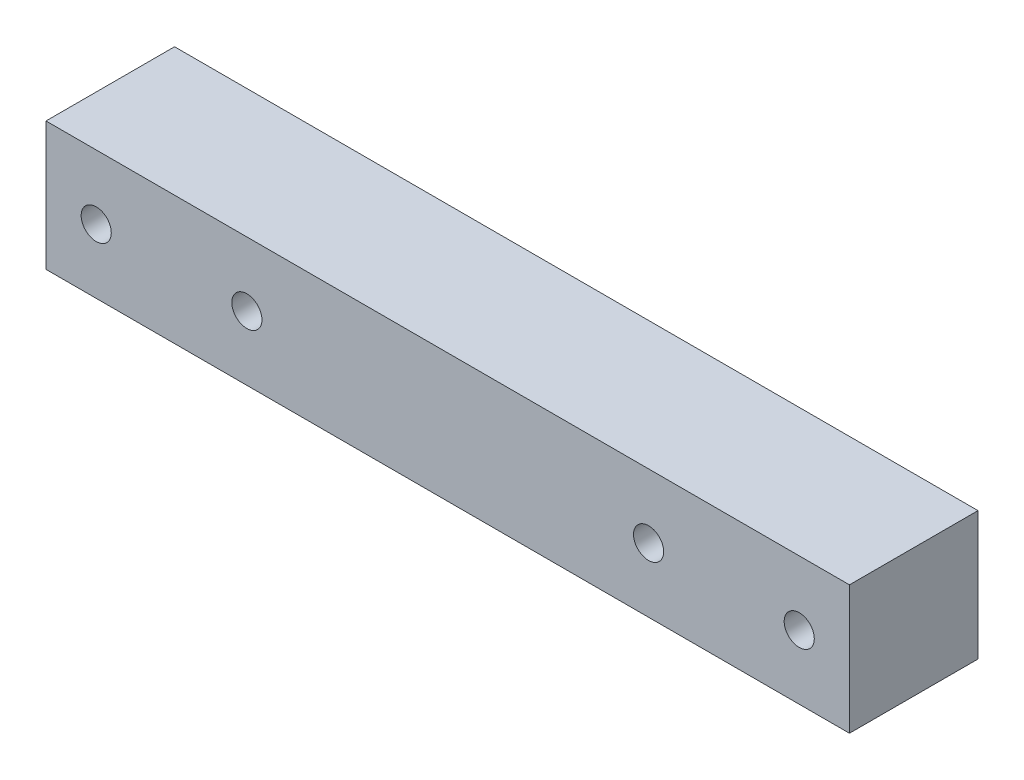
ISO-10303-21;
HEADER;
FILE_DESCRIPTION(('STEP AP214'),'2;1');
FILE_NAME('part.step','',(''),(''),'','','');
FILE_SCHEMA(('AUTOMOTIVE_DESIGN { 1 0 10303 214 1 1 1 1 }'));
ENDSEC;
DATA;
#1=APPLICATION_CONTEXT('core data for automotive mechanical design processes');
#2=APPLICATION_PROTOCOL_DEFINITION('international standard','automotive_design',2000,#1);
#3=PRODUCT_CONTEXT('',#1,'mechanical');
#4=PRODUCT('Part','Part','',(#3));
#5=PRODUCT_RELATED_PRODUCT_CATEGORY('part','',(#4));
#6=PRODUCT_DEFINITION_FORMATION('','',#4);
#7=PRODUCT_DEFINITION_CONTEXT('part definition',#1,'design');
#8=PRODUCT_DEFINITION('design','',#6,#7);
#9=PRODUCT_DEFINITION_SHAPE('','',#8);
#10=(LENGTH_UNIT() NAMED_UNIT(*) SI_UNIT(.MILLI.,.METRE.));
#11=(NAMED_UNIT(*) PLANE_ANGLE_UNIT() SI_UNIT($,.RADIAN.));
#12=(NAMED_UNIT(*) SI_UNIT($,.STERADIAN.) SOLID_ANGLE_UNIT());
#13=UNCERTAINTY_MEASURE_WITH_UNIT(LENGTH_MEASURE(1.E-05),#10,'distance_accuracy_value','');
#14=(GEOMETRIC_REPRESENTATION_CONTEXT(3) GLOBAL_UNCERTAINTY_ASSIGNED_CONTEXT((#13)) GLOBAL_UNIT_ASSIGNED_CONTEXT((#10,
#11,#12)) REPRESENTATION_CONTEXT('',''));
#15=CARTESIAN_POINT('',(0.,0.,0.));
#16=DIRECTION('',(0.,0.,1.));
#17=DIRECTION('',(1.,0.,0.));
#18=AXIS2_PLACEMENT_3D('',#15,#16,#17);
#19=CARTESIAN_POINT('',(0.,0.,12.8));
#20=DIRECTION('',(0.,0.,-1.));
#21=DIRECTION('',(-1.,0.,0.));
#22=AXIS2_PLACEMENT_3D('',#19,#20,#21);
#23=PLANE('',#22);
#24=CARTESIAN_POINT('',(60.,6.4,12.8));
#25=DIRECTION('',(0.,0.,1.));
#26=DIRECTION('',(1.,0.,0.));
#27=AXIS2_PLACEMENT_3D('',#24,#25,#26);
#28=CIRCLE('',#27,1.5);
#29=CARTESIAN_POINT('',(61.5,6.4,12.8));
#30=VERTEX_POINT('',#29);
#31=EDGE_CURVE('E137',#30,#30,#28,.T.);
#32=ORIENTED_EDGE('',*,*,#31,.F.);
#33=EDGE_LOOP('',(#32));
#34=FACE_BOUND('',#33,.T.);
#35=CARTESIAN_POINT('',(75.,6.4,12.8));
#36=DIRECTION('',(0.,0.,1.));
#37=DIRECTION('',(1.,0.,0.));
#38=AXIS2_PLACEMENT_3D('',#35,#36,#37);
#39=CIRCLE('',#38,1.5);
#40=CARTESIAN_POINT('',(76.5,6.4,12.8));
#41=VERTEX_POINT('',#40);
#42=EDGE_CURVE('E129',#41,#41,#39,.T.);
#43=ORIENTED_EDGE('',*,*,#42,.F.);
#44=EDGE_LOOP('',(#43));
#45=FACE_BOUND('',#44,.T.);
#46=DIRECTION('',(0.,-1.,0.));
#47=VECTOR('',#46,1.);
#48=CARTESIAN_POINT('',(0.,0.,12.8));
#49=LINE('',#48,#47);
#50=CARTESIAN_POINT('',(0.,12.8,12.8));
#51=VERTEX_POINT('',#50);
#52=CARTESIAN_POINT('',(0.,0.,12.8));
#53=VERTEX_POINT('',#52);
#54=EDGE_CURVE('E91',#51,#53,#49,.T.);
#55=ORIENTED_EDGE('',*,*,#54,.T.);
#56=DIRECTION('',(1.,0.,0.));
#57=VECTOR('',#56,1.);
#58=CARTESIAN_POINT('',(0.,0.,12.8));
#59=LINE('',#58,#57);
#60=CARTESIAN_POINT('',(80.,0.,12.8));
#61=VERTEX_POINT('',#60);
#62=EDGE_CURVE('E86',#53,#61,#59,.T.);
#63=ORIENTED_EDGE('',*,*,#62,.T.);
#64=DIRECTION('',(0.,1.,0.));
#65=VECTOR('',#64,1.);
#66=CARTESIAN_POINT('',(80.,0.,12.8));
#67=LINE('',#66,#65);
#68=CARTESIAN_POINT('',(80.,12.8,12.8));
#69=VERTEX_POINT('',#68);
#70=EDGE_CURVE('E89',#61,#69,#67,.T.);
#71=ORIENTED_EDGE('',*,*,#70,.T.);
#72=DIRECTION('',(-1.,0.,0.));
#73=VECTOR('',#72,1.);
#74=CARTESIAN_POINT('',(0.,12.8,12.8));
#75=LINE('',#74,#73);
#76=EDGE_CURVE('E56',#69,#51,#75,.T.);
#77=ORIENTED_EDGE('',*,*,#76,.T.);
#78=EDGE_LOOP('',(#55,#63,#71,#77));
#79=FACE_BOUND('',#78,.T.);
#80=CARTESIAN_POINT('',(20.,6.4,12.8));
#81=DIRECTION('',(0.,0.,1.));
#82=DIRECTION('',(1.,0.,0.));
#83=AXIS2_PLACEMENT_3D('',#80,#81,#82);
#84=CIRCLE('',#83,1.5);
#85=CARTESIAN_POINT('',(21.5,6.4,12.8));
#86=VERTEX_POINT('',#85);
#87=EDGE_CURVE('E145',#86,#86,#84,.F.);
#88=ORIENTED_EDGE('',*,*,#87,.T.);
#89=EDGE_LOOP('',(#88));
#90=FACE_BOUND('',#89,.T.);
#91=CARTESIAN_POINT('',(5.,6.4,12.8));
#92=DIRECTION('',(0.,0.,1.));
#93=DIRECTION('',(1.,0.,0.));
#94=AXIS2_PLACEMENT_3D('',#91,#92,#93);
#95=CIRCLE('',#94,1.5);
#96=CARTESIAN_POINT('',(6.5,6.4,12.8));
#97=VERTEX_POINT('',#96);
#98=EDGE_CURVE('E153',#97,#97,#95,.F.);
#99=ORIENTED_EDGE('',*,*,#98,.T.);
#100=EDGE_LOOP('',(#99));
#101=FACE_BOUND('',#100,.T.);
#102=ADVANCED_FACE('F38',(#34,#45,#79,#90,#101),#23,.F.);
#103=CARTESIAN_POINT('',(0.,0.,0.));
#104=DIRECTION('',(0.,0.,-1.));
#105=DIRECTION('',(-1.,0.,0.));
#106=AXIS2_PLACEMENT_3D('',#103,#104,#105);
#107=PLANE('',#106);
#108=CARTESIAN_POINT('',(20.,6.4,0.));
#109=DIRECTION('',(0.,0.,1.));
#110=DIRECTION('',(1.,0.,0.));
#111=AXIS2_PLACEMENT_3D('',#108,#109,#110);
#112=CIRCLE('',#111,1.5);
#113=CARTESIAN_POINT('',(21.5,6.4,0.));
#114=VERTEX_POINT('',#113);
#115=EDGE_CURVE('E149',#114,#114,#112,.F.);
#116=ORIENTED_EDGE('',*,*,#115,.F.);
#117=EDGE_LOOP('',(#116));
#118=FACE_BOUND('',#117,.T.);
#119=CARTESIAN_POINT('',(60.,6.4,0.));
#120=DIRECTION('',(0.,0.,1.));
#121=DIRECTION('',(1.,0.,0.));
#122=AXIS2_PLACEMENT_3D('',#119,#120,#121);
#123=CIRCLE('',#122,1.5);
#124=CARTESIAN_POINT('',(61.5,6.4,0.));
#125=VERTEX_POINT('',#124);
#126=EDGE_CURVE('E141',#125,#125,#123,.T.);
#127=ORIENTED_EDGE('',*,*,#126,.T.);
#128=EDGE_LOOP('',(#127));
#129=FACE_BOUND('',#128,.T.);
#130=CARTESIAN_POINT('',(75.,6.4,0.));
#131=DIRECTION('',(0.,0.,1.));
#132=DIRECTION('',(1.,0.,0.));
#133=AXIS2_PLACEMENT_3D('',#130,#131,#132);
#134=CIRCLE('',#133,1.5);
#135=CARTESIAN_POINT('',(76.5,6.4,0.));
#136=VERTEX_POINT('',#135);
#137=EDGE_CURVE('E133',#136,#136,#134,.T.);
#138=ORIENTED_EDGE('',*,*,#137,.T.);
#139=EDGE_LOOP('',(#138));
#140=FACE_BOUND('',#139,.T.);
#141=DIRECTION('',(0.,-1.,0.));
#142=VECTOR('',#141,1.);
#143=CARTESIAN_POINT('',(0.,0.,0.));
#144=LINE('',#143,#142);
#145=CARTESIAN_POINT('',(0.,12.8,0.));
#146=VERTEX_POINT('',#145);
#147=CARTESIAN_POINT('',(0.,0.,0.));
#148=VERTEX_POINT('',#147);
#149=EDGE_CURVE('E107',#146,#148,#144,.T.);
#150=ORIENTED_EDGE('',*,*,#149,.F.);
#151=DIRECTION('',(-1.,0.,0.));
#152=VECTOR('',#151,1.);
#153=CARTESIAN_POINT('',(0.,12.8,0.));
#154=LINE('',#153,#152);
#155=CARTESIAN_POINT('',(80.,12.8,0.));
#156=VERTEX_POINT('',#155);
#157=EDGE_CURVE('E79',#156,#146,#154,.T.);
#158=ORIENTED_EDGE('',*,*,#157,.F.);
#159=DIRECTION('',(0.,1.,0.));
#160=VECTOR('',#159,1.);
#161=CARTESIAN_POINT('',(80.,0.,0.));
#162=LINE('',#161,#160);
#163=CARTESIAN_POINT('',(80.,0.,0.));
#164=VERTEX_POINT('',#163);
#165=EDGE_CURVE('E73',#164,#156,#162,.T.);
#166=ORIENTED_EDGE('',*,*,#165,.F.);
#167=DIRECTION('',(1.,0.,0.));
#168=VECTOR('',#167,1.);
#169=CARTESIAN_POINT('',(0.,0.,0.));
#170=LINE('',#169,#168);
#171=EDGE_CURVE('E96',#148,#164,#170,.T.);
#172=ORIENTED_EDGE('',*,*,#171,.F.);
#173=EDGE_LOOP('',(#150,#158,#166,#172));
#174=FACE_BOUND('',#173,.T.);
#175=CARTESIAN_POINT('',(5.,6.4,0.));
#176=DIRECTION('',(0.,0.,1.));
#177=DIRECTION('',(1.,0.,0.));
#178=AXIS2_PLACEMENT_3D('',#175,#176,#177);
#179=CIRCLE('',#178,1.5);
#180=CARTESIAN_POINT('',(6.5,6.4,0.));
#181=VERTEX_POINT('',#180);
#182=EDGE_CURVE('E111',#181,#181,#179,.F.);
#183=ORIENTED_EDGE('',*,*,#182,.F.);
#184=EDGE_LOOP('',(#183));
#185=FACE_BOUND('',#184,.T.);
#186=ADVANCED_FACE('F124',(#118,#129,#140,#174,#185),#107,.T.);
#187=CARTESIAN_POINT('',(0.,0.,12.8));
#188=DIRECTION('',(1.,0.,0.));
#189=DIRECTION('',(0.,0.,-1.));
#190=AXIS2_PLACEMENT_3D('',#187,#188,#189);
#191=PLANE('',#190);
#192=ORIENTED_EDGE('',*,*,#149,.T.);
#193=DIRECTION('',(0.,0.,-1.));
#194=VECTOR('',#193,1.);
#195=CARTESIAN_POINT('',(0.,0.,12.8));
#196=LINE('',#195,#194);
#197=EDGE_CURVE('E11',#53,#148,#196,.T.);
#198=ORIENTED_EDGE('',*,*,#197,.F.);
#199=ORIENTED_EDGE('',*,*,#54,.F.);
#200=DIRECTION('',(0.,0.,-1.));
#201=VECTOR('',#200,1.);
#202=CARTESIAN_POINT('',(0.,12.8,12.8));
#203=LINE('',#202,#201);
#204=EDGE_CURVE('E103',#51,#146,#203,.T.);
#205=ORIENTED_EDGE('',*,*,#204,.T.);
#206=EDGE_LOOP('',(#192,#198,#199,#205));
#207=FACE_BOUND('',#206,.T.);
#208=ADVANCED_FACE('F40',(#207),#191,.F.);
#209=CARTESIAN_POINT('',(0.,0.,12.8));
#210=DIRECTION('',(0.,1.,0.));
#211=DIRECTION('',(0.,0.,1.));
#212=AXIS2_PLACEMENT_3D('',#209,#210,#211);
#213=PLANE('',#212);
#214=ORIENTED_EDGE('',*,*,#171,.T.);
#215=DIRECTION('',(0.,0.,-1.));
#216=VECTOR('',#215,1.);
#217=CARTESIAN_POINT('',(80.,0.,12.8));
#218=LINE('',#217,#216);
#219=EDGE_CURVE('E48',#61,#164,#218,.T.);
#220=ORIENTED_EDGE('',*,*,#219,.F.);
#221=ORIENTED_EDGE('',*,*,#62,.F.);
#222=ORIENTED_EDGE('',*,*,#197,.T.);
#223=EDGE_LOOP('',(#214,#220,#221,#222));
#224=FACE_BOUND('',#223,.T.);
#225=ADVANCED_FACE('F95',(#224),#213,.F.);
#226=CARTESIAN_POINT('',(80.,0.,12.8));
#227=DIRECTION('',(-1.,0.,0.));
#228=DIRECTION('',(0.,0.,1.));
#229=AXIS2_PLACEMENT_3D('',#226,#227,#228);
#230=PLANE('',#229);
#231=ORIENTED_EDGE('',*,*,#165,.T.);
#232=DIRECTION('',(0.,0.,-1.));
#233=VECTOR('',#232,1.);
#234=CARTESIAN_POINT('',(80.,12.8,12.8));
#235=LINE('',#234,#233);
#236=EDGE_CURVE('E98',#69,#156,#235,.T.);
#237=ORIENTED_EDGE('',*,*,#236,.F.);
#238=ORIENTED_EDGE('',*,*,#70,.F.);
#239=ORIENTED_EDGE('',*,*,#219,.T.);
#240=EDGE_LOOP('',(#231,#237,#238,#239));
#241=FACE_BOUND('',#240,.T.);
#242=ADVANCED_FACE('F99',(#241),#230,.F.);
#243=CARTESIAN_POINT('',(0.,12.8,12.8));
#244=DIRECTION('',(0.,-1.,0.));
#245=DIRECTION('',(0.,0.,-1.));
#246=AXIS2_PLACEMENT_3D('',#243,#244,#245);
#247=PLANE('',#246);
#248=ORIENTED_EDGE('',*,*,#157,.T.);
#249=ORIENTED_EDGE('',*,*,#204,.F.);
#250=ORIENTED_EDGE('',*,*,#76,.F.);
#251=ORIENTED_EDGE('',*,*,#236,.T.);
#252=EDGE_LOOP('',(#248,#249,#250,#251));
#253=FACE_BOUND('',#252,.T.);
#254=ADVANCED_FACE('F121',(#253),#247,.F.);
#255=CARTESIAN_POINT('',(75.,6.4,0.));
#256=DIRECTION('',(0.,0.,1.));
#257=DIRECTION('',(1.,0.,0.));
#258=AXIS2_PLACEMENT_3D('',#255,#256,#257);
#259=CYLINDRICAL_SURFACE('',#258,1.5);
#260=ORIENTED_EDGE('',*,*,#137,.F.);
#261=EDGE_LOOP('',(#260));
#262=FACE_BOUND('',#261,.T.);
#263=ORIENTED_EDGE('',*,*,#42,.T.);
#264=EDGE_LOOP('',(#263));
#265=FACE_BOUND('',#264,.T.);
#266=ADVANCED_FACE('F178',(#262,#265),#259,.F.);
#267=CARTESIAN_POINT('',(60.,6.4,0.));
#268=DIRECTION('',(0.,0.,1.));
#269=DIRECTION('',(1.,0.,0.));
#270=AXIS2_PLACEMENT_3D('',#267,#268,#269);
#271=CYLINDRICAL_SURFACE('',#270,1.5);
#272=ORIENTED_EDGE('',*,*,#126,.F.);
#273=EDGE_LOOP('',(#272));
#274=FACE_BOUND('',#273,.T.);
#275=ORIENTED_EDGE('',*,*,#31,.T.);
#276=EDGE_LOOP('',(#275));
#277=FACE_BOUND('',#276,.T.);
#278=ADVANCED_FACE('F200',(#274,#277),#271,.F.);
#279=CARTESIAN_POINT('',(20.,6.4,0.));
#280=DIRECTION('',(0.,0.,1.));
#281=DIRECTION('',(1.,0.,0.));
#282=AXIS2_PLACEMENT_3D('',#279,#280,#281);
#283=CYLINDRICAL_SURFACE('',#282,1.5);
#284=ORIENTED_EDGE('',*,*,#115,.T.);
#285=EDGE_LOOP('',(#284));
#286=FACE_BOUND('',#285,.T.);
#287=ORIENTED_EDGE('',*,*,#87,.F.);
#288=EDGE_LOOP('',(#287));
#289=FACE_BOUND('',#288,.T.);
#290=ADVANCED_FACE('F207',(#286,#289),#283,.F.);
#291=CARTESIAN_POINT('',(5.,6.4,0.));
#292=DIRECTION('',(0.,0.,1.));
#293=DIRECTION('',(1.,0.,0.));
#294=AXIS2_PLACEMENT_3D('',#291,#292,#293);
#295=CYLINDRICAL_SURFACE('',#294,1.5);
#296=ORIENTED_EDGE('',*,*,#182,.T.);
#297=EDGE_LOOP('',(#296));
#298=FACE_BOUND('',#297,.T.);
#299=ORIENTED_EDGE('',*,*,#98,.F.);
#300=EDGE_LOOP('',(#299));
#301=FACE_BOUND('',#300,.T.);
#302=ADVANCED_FACE('F161',(#298,#301),#295,.F.);
#303=CLOSED_SHELL('',(#102,#186,#208,#225,#242,#254,#266,#278,#290,#302));
#304=MANIFOLD_SOLID_BREP('B2',#303);
#305=ADVANCED_BREP_SHAPE_REPRESENTATION('',(#18,#304),#14);
#306=SHAPE_DEFINITION_REPRESENTATION(#9,#305);
ENDSEC;
END-ISO-10303-21;
